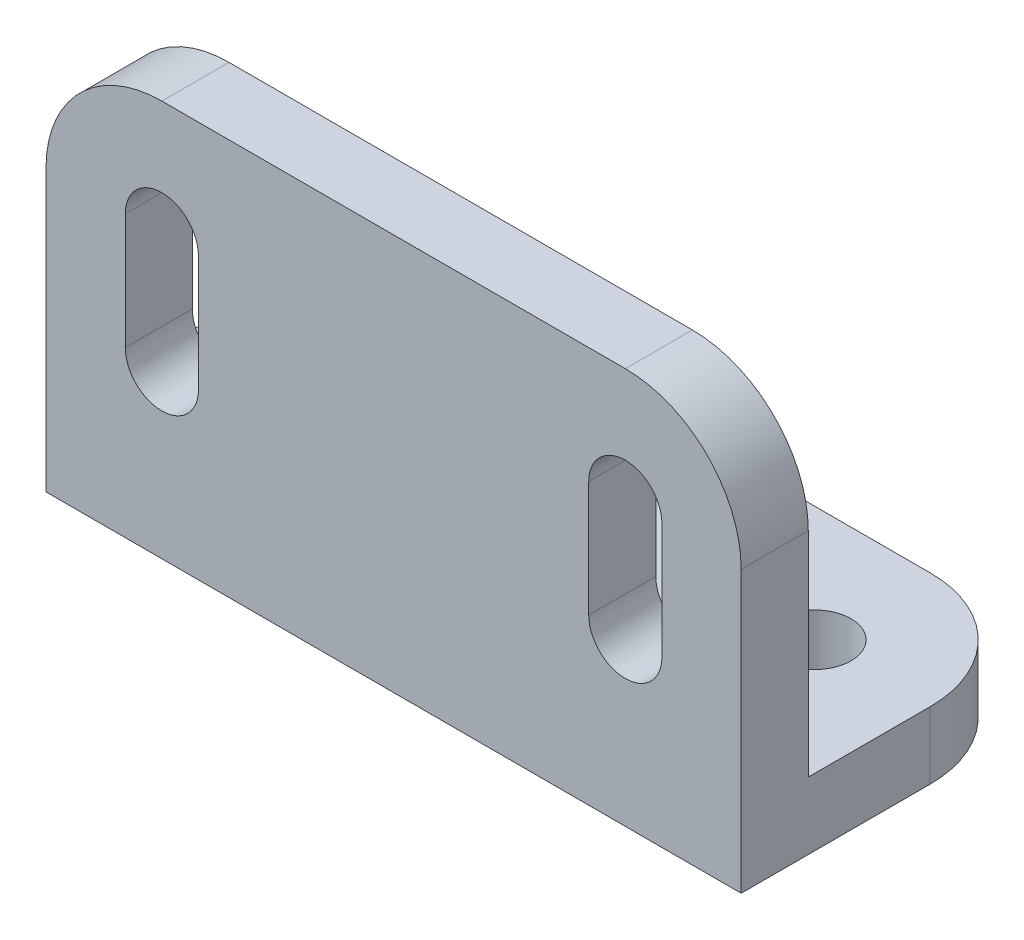
ISO-10303-21;
HEADER;
FILE_DESCRIPTION(('STEP AP214'),'2;1');
FILE_NAME('part.step','',(''),(''),'','','');
FILE_SCHEMA(('AUTOMOTIVE_DESIGN { 1 0 10303 214 1 1 1 1 }'));
ENDSEC;
DATA;
#1=APPLICATION_CONTEXT('core data for automotive mechanical design processes');
#2=APPLICATION_PROTOCOL_DEFINITION('international standard','automotive_design',2000,#1);
#3=PRODUCT_CONTEXT('',#1,'mechanical');
#4=PRODUCT('Part','Part','',(#3));
#5=PRODUCT_RELATED_PRODUCT_CATEGORY('part','',(#4));
#6=PRODUCT_DEFINITION_FORMATION('','',#4);
#7=PRODUCT_DEFINITION_CONTEXT('part definition',#1,'design');
#8=PRODUCT_DEFINITION('design','',#6,#7);
#9=PRODUCT_DEFINITION_SHAPE('','',#8);
#10=(LENGTH_UNIT() NAMED_UNIT(*) SI_UNIT(.MILLI.,.METRE.));
#11=(NAMED_UNIT(*) PLANE_ANGLE_UNIT() SI_UNIT($,.RADIAN.));
#12=(NAMED_UNIT(*) SI_UNIT($,.STERADIAN.) SOLID_ANGLE_UNIT());
#13=UNCERTAINTY_MEASURE_WITH_UNIT(LENGTH_MEASURE(1.E-05),#10,'distance_accuracy_value','');
#14=(GEOMETRIC_REPRESENTATION_CONTEXT(3) GLOBAL_UNCERTAINTY_ASSIGNED_CONTEXT((#13)) GLOBAL_UNIT_ASSIGNED_CONTEXT((#10,
#11,#12)) REPRESENTATION_CONTEXT('',''));
#15=CARTESIAN_POINT('',(0.,0.,0.));
#16=DIRECTION('',(0.,0.,1.));
#17=DIRECTION('',(1.,0.,0.));
#18=AXIS2_PLACEMENT_3D('',#15,#16,#17);
#19=CARTESIAN_POINT('',(0.,11.,0.));
#20=DIRECTION('',(0.,1.,0.));
#21=DIRECTION('',(0.,0.,1.));
#22=AXIS2_PLACEMENT_3D('',#19,#20,#21);
#23=PLANE('',#22);
#24=CARTESIAN_POINT('',(38.,11.,-31.));
#25=DIRECTION('',(0.,1.,0.));
#26=DIRECTION('',(0.,0.,1.));
#27=AXIS2_PLACEMENT_3D('',#24,#25,#26);
#28=CIRCLE('',#27,6.);
#29=CARTESIAN_POINT('',(38.,11.,-25.));
#30=VERTEX_POINT('',#29);
#31=EDGE_CURVE('E391',#30,#30,#28,.F.);
#32=ORIENTED_EDGE('',*,*,#31,.T.);
#33=EDGE_LOOP('',(#32));
#34=FACE_BOUND('',#33,.T.);
#35=DIRECTION('',(-1.,0.,0.));
#36=VECTOR('',#35,1.);
#37=CARTESIAN_POINT('',(-57.,11.,-50.));
#38=LINE('',#37,#36);
#39=CARTESIAN_POINT('',(38.,11.,-50.));
#40=VERTEX_POINT('',#39);
#41=CARTESIAN_POINT('',(3.,11.,-50.));
#42=VERTEX_POINT('',#41);
#43=EDGE_CURVE('E208',#40,#42,#38,.T.);
#44=ORIENTED_EDGE('',*,*,#43,.T.);
#45=DIRECTION('',(0.,0.,1.));
#46=VECTOR('',#45,1.);
#47=CARTESIAN_POINT('',(3.,11.,0.));
#48=LINE('',#47,#46);
#49=CARTESIAN_POINT('',(3.,11.,-11.));
#50=VERTEX_POINT('',#49);
#51=EDGE_CURVE('E184',#42,#50,#48,.T.);
#52=ORIENTED_EDGE('',*,*,#51,.T.);
#53=DIRECTION('',(1.,0.,0.));
#54=VECTOR('',#53,1.);
#55=CARTESIAN_POINT('',(0.,11.,-11.));
#56=LINE('',#55,#54);
#57=CARTESIAN_POINT('',(57.,11.,-11.));
#58=VERTEX_POINT('',#57);
#59=EDGE_CURVE('E416',#50,#58,#56,.T.);
#60=ORIENTED_EDGE('',*,*,#59,.T.);
#61=DIRECTION('',(0.,0.,-1.));
#62=VECTOR('',#61,1.);
#63=CARTESIAN_POINT('',(57.,11.,-50.));
#64=LINE('',#63,#62);
#65=CARTESIAN_POINT('',(57.,11.,-31.));
#66=VERTEX_POINT('',#65);
#67=EDGE_CURVE('E225',#58,#66,#64,.T.);
#68=ORIENTED_EDGE('',*,*,#67,.T.);
#69=CARTESIAN_POINT('',(38.,11.,-31.));
#70=DIRECTION('',(0.,1.,0.));
#71=DIRECTION('',(0.,0.,1.));
#72=AXIS2_PLACEMENT_3D('',#69,#70,#71);
#73=CIRCLE('',#72,19.);
#74=EDGE_CURVE('E216',#66,#40,#73,.T.);
#75=ORIENTED_EDGE('',*,*,#74,.T.);
#76=EDGE_LOOP('',(#44,#52,#60,#68,#75));
#77=FACE_BOUND('',#76,.T.);
#78=ADVANCED_FACE('F39',(#34,#77),#23,.T.);
#79=CARTESIAN_POINT('',(-57.,65.,-11.));
#80=DIRECTION('',(0.,0.,1.));
#81=DIRECTION('',(1.,0.,0.));
#82=AXIS2_PLACEMENT_3D('',#79,#80,#81);
#83=PLANE('',#82);
#84=DIRECTION('',(0.,-1.,0.));
#85=VECTOR('',#84,1.);
#86=CARTESIAN_POINT('',(32.,65.,-11.));
#87=LINE('',#86,#85);
#88=CARTESIAN_POINT('',(32.,46.,-11.));
#89=VERTEX_POINT('',#88);
#90=CARTESIAN_POINT('',(32.,27.,-11.));
#91=VERTEX_POINT('',#90);
#92=EDGE_CURVE('E312',#89,#91,#87,.T.);
#93=ORIENTED_EDGE('',*,*,#92,.T.);
#94=CARTESIAN_POINT('',(38.,27.,-11.));
#95=DIRECTION('',(0.,0.,1.));
#96=DIRECTION('',(1.,0.,0.));
#97=AXIS2_PLACEMENT_3D('',#94,#95,#96);
#98=CIRCLE('',#97,5.99999999999999);
#99=CARTESIAN_POINT('',(44.,27.,-11.));
#100=VERTEX_POINT('',#99);
#101=EDGE_CURVE('E316',#91,#100,#98,.T.);
#102=ORIENTED_EDGE('',*,*,#101,.T.);
#103=DIRECTION('',(0.,1.,0.));
#104=VECTOR('',#103,1.);
#105=CARTESIAN_POINT('',(44.,65.,-11.));
#106=LINE('',#105,#104);
#107=CARTESIAN_POINT('',(44.,46.,-11.));
#108=VERTEX_POINT('',#107);
#109=EDGE_CURVE('E304',#100,#108,#106,.T.);
#110=ORIENTED_EDGE('',*,*,#109,.T.);
#111=CARTESIAN_POINT('',(38.,46.,-11.));
#112=DIRECTION('',(0.,0.,1.));
#113=DIRECTION('',(1.,0.,0.));
#114=AXIS2_PLACEMENT_3D('',#111,#112,#113);
#115=CIRCLE('',#114,6.);
#116=EDGE_CURVE('E308',#108,#89,#115,.T.);
#117=ORIENTED_EDGE('',*,*,#116,.T.);
#118=EDGE_LOOP('',(#93,#102,#110,#117));
#119=FACE_BOUND('',#118,.T.);
#120=DIRECTION('',(0.,-1.,0.));
#121=VECTOR('',#120,1.);
#122=CARTESIAN_POINT('',(3.,65.,-11.));
#123=LINE('',#122,#121);
#124=CARTESIAN_POINT('',(3.,65.,-11.));
#125=VERTEX_POINT('',#124);
#126=EDGE_CURVE('E189',#125,#50,#123,.T.);
#127=ORIENTED_EDGE('',*,*,#126,.F.);
#128=DIRECTION('',(-1.,0.,0.));
#129=VECTOR('',#128,1.);
#130=CARTESIAN_POINT('',(-57.,65.,-11.));
#131=LINE('',#130,#129);
#132=CARTESIAN_POINT('',(38.,65.,-11.));
#133=VERTEX_POINT('',#132);
#134=EDGE_CURVE('E403',#133,#125,#131,.T.);
#135=ORIENTED_EDGE('',*,*,#134,.F.);
#136=CARTESIAN_POINT('',(38.,46.,-11.));
#137=DIRECTION('',(0.,0.,1.));
#138=DIRECTION('',(1.,0.,0.));
#139=AXIS2_PLACEMENT_3D('',#136,#137,#138);
#140=CIRCLE('',#139,19.);
#141=CARTESIAN_POINT('',(57.,46.,-11.));
#142=VERTEX_POINT('',#141);
#143=EDGE_CURVE('E294',#133,#142,#140,.F.);
#144=ORIENTED_EDGE('',*,*,#143,.T.);
#145=DIRECTION('',(0.,-1.,0.));
#146=VECTOR('',#145,1.);
#147=CARTESIAN_POINT('',(57.,65.,-11.));
#148=LINE('',#147,#146);
#149=EDGE_CURVE('E413',#142,#58,#148,.T.);
#150=ORIENTED_EDGE('',*,*,#149,.T.);
#151=ORIENTED_EDGE('',*,*,#59,.F.);
#152=EDGE_LOOP('',(#127,#135,#144,#150,#151));
#153=FACE_BOUND('',#152,.T.);
#154=ADVANCED_FACE('F426',(#119,#153),#83,.F.);
#155=DIRECTION('',(0.,0.,1.));
#156=VECTOR('',#155,1.);
#157=CARTESIAN_POINT('',(-3.,11.,0.));
#158=LINE('',#157,#156);
#159=CARTESIAN_POINT('',(-3.,11.,-50.));
#160=VERTEX_POINT('',#159);
#161=CARTESIAN_POINT('',(-3.,11.,-11.));
#162=VERTEX_POINT('',#161);
#163=EDGE_CURVE('E472',#160,#162,#158,.T.);
#164=ORIENTED_EDGE('',*,*,#163,.F.);
#165=CARTESIAN_POINT('',(-38.,11.,-50.));
#166=VERTEX_POINT('',#165);
#167=EDGE_CURVE('E211',#160,#166,#38,.T.);
#168=ORIENTED_EDGE('',*,*,#167,.T.);
#169=CARTESIAN_POINT('',(-38.,11.,-31.));
#170=DIRECTION('',(0.,1.,0.));
#171=DIRECTION('',(0.,0.,1.));
#172=AXIS2_PLACEMENT_3D('',#169,#170,#171);
#173=CIRCLE('',#172,19.);
#174=CARTESIAN_POINT('',(-57.,11.,-31.));
#175=VERTEX_POINT('',#174);
#176=EDGE_CURVE('E267',#166,#175,#173,.T.);
#177=ORIENTED_EDGE('',*,*,#176,.T.);
#178=DIRECTION('',(0.,0.,1.));
#179=VECTOR('',#178,1.);
#180=CARTESIAN_POINT('',(-57.,11.,-50.));
#181=LINE('',#180,#179);
#182=CARTESIAN_POINT('',(-57.,11.,-11.));
#183=VERTEX_POINT('',#182);
#184=EDGE_CURVE('E218',#175,#183,#181,.T.);
#185=ORIENTED_EDGE('',*,*,#184,.T.);
#186=EDGE_CURVE('E233',#183,#162,#56,.T.);
#187=ORIENTED_EDGE('',*,*,#186,.T.);
#188=EDGE_LOOP('',(#164,#168,#177,#185,#187));
#189=FACE_BOUND('',#188,.T.);
#190=CARTESIAN_POINT('',(-38.,11.,-31.));
#191=DIRECTION('',(0.,1.,0.));
#192=DIRECTION('',(0.,0.,1.));
#193=AXIS2_PLACEMENT_3D('',#190,#191,#192);
#194=CIRCLE('',#193,6.);
#195=CARTESIAN_POINT('',(-38.,11.,-25.));
#196=VERTEX_POINT('',#195);
#197=EDGE_CURVE('E398',#196,#196,#194,.F.);
#198=ORIENTED_EDGE('',*,*,#197,.T.);
#199=EDGE_LOOP('',(#198));
#200=FACE_BOUND('',#199,.T.);
#201=ADVANCED_FACE('F448',(#189,#200),#23,.T.);
#202=CARTESIAN_POINT('',(57.,11.,-50.));
#203=DIRECTION('',(-1.,0.,0.));
#204=DIRECTION('',(0.,0.,1.));
#205=AXIS2_PLACEMENT_3D('',#202,#203,#204);
#206=PLANE('',#205);
#207=ORIENTED_EDGE('',*,*,#149,.F.);
#208=DIRECTION('',(0.,0.,-1.));
#209=VECTOR('',#208,1.);
#210=CARTESIAN_POINT('',(57.,46.,0.));
#211=LINE('',#210,#209);
#212=CARTESIAN_POINT('',(57.,46.,0.));
#213=VERTEX_POINT('',#212);
#214=EDGE_CURVE('E301',#142,#213,#211,.F.);
#215=ORIENTED_EDGE('',*,*,#214,.T.);
#216=DIRECTION('',(0.,-1.,0.));
#217=VECTOR('',#216,1.);
#218=CARTESIAN_POINT('',(57.,11.,0.));
#219=LINE('',#218,#217);
#220=CARTESIAN_POINT('',(57.,0.,0.));
#221=VERTEX_POINT('',#220);
#222=EDGE_CURVE('E223',#213,#221,#219,.T.);
#223=ORIENTED_EDGE('',*,*,#222,.T.);
#224=DIRECTION('',(0.,0.,-1.));
#225=VECTOR('',#224,1.);
#226=CARTESIAN_POINT('',(57.,0.,-50.));
#227=LINE('',#226,#225);
#228=CARTESIAN_POINT('',(57.,0.,-31.));
#229=VERTEX_POINT('',#228);
#230=EDGE_CURVE('E229',#221,#229,#227,.T.);
#231=ORIENTED_EDGE('',*,*,#230,.T.);
#232=DIRECTION('',(0.,-1.,0.));
#233=VECTOR('',#232,1.);
#234=CARTESIAN_POINT('',(57.,11.,-31.));
#235=LINE('',#234,#233);
#236=EDGE_CURVE('E263',#229,#66,#235,.F.);
#237=ORIENTED_EDGE('',*,*,#236,.T.);
#238=ORIENTED_EDGE('',*,*,#67,.F.);
#239=EDGE_LOOP('',(#207,#215,#223,#231,#237,#238));
#240=FACE_BOUND('',#239,.T.);
#241=ADVANCED_FACE('F430',(#240),#206,.F.);
#242=CARTESIAN_POINT('',(-57.,11.,-50.));
#243=DIRECTION('',(0.,0.,1.));
#244=DIRECTION('',(1.,0.,0.));
#245=AXIS2_PLACEMENT_3D('',#242,#243,#244);
#246=PLANE('',#245);
#247=ORIENTED_EDGE('',*,*,#167,.F.);
#248=DIRECTION('',(-1.,0.,0.));
#249=VECTOR('',#248,1.);
#250=CARTESIAN_POINT('',(3.,11.,-50.));
#251=LINE('',#250,#249);
#252=EDGE_CURVE('E198',#42,#160,#251,.T.);
#253=ORIENTED_EDGE('',*,*,#252,.F.);
#254=ORIENTED_EDGE('',*,*,#43,.F.);
#255=DIRECTION('',(0.,-1.,0.));
#256=VECTOR('',#255,1.);
#257=CARTESIAN_POINT('',(38.,11.,-50.));
#258=LINE('',#257,#256);
#259=CARTESIAN_POINT('',(38.,0.,-50.));
#260=VERTEX_POINT('',#259);
#261=EDGE_CURVE('E252',#40,#260,#258,.T.);
#262=ORIENTED_EDGE('',*,*,#261,.T.);
#263=DIRECTION('',(-1.,0.,0.));
#264=VECTOR('',#263,1.);
#265=CARTESIAN_POINT('',(-57.,0.,-50.));
#266=LINE('',#265,#264);
#267=CARTESIAN_POINT('',(-38.,0.,-50.));
#268=VERTEX_POINT('',#267);
#269=EDGE_CURVE('E232',#260,#268,#266,.T.);
#270=ORIENTED_EDGE('',*,*,#269,.T.);
#271=DIRECTION('',(0.,-1.,0.));
#272=VECTOR('',#271,1.);
#273=CARTESIAN_POINT('',(-38.,11.,-50.));
#274=LINE('',#273,#272);
#275=EDGE_CURVE('E249',#268,#166,#274,.F.);
#276=ORIENTED_EDGE('',*,*,#275,.T.);
#277=EDGE_LOOP('',(#247,#253,#254,#262,#270,#276));
#278=FACE_BOUND('',#277,.T.);
#279=ADVANCED_FACE('F206',(#278),#246,.F.);
#280=CARTESIAN_POINT('',(-57.,11.,-50.));
#281=DIRECTION('',(1.,0.,0.));
#282=DIRECTION('',(0.,0.,-1.));
#283=AXIS2_PLACEMENT_3D('',#280,#281,#282);
#284=PLANE('',#283);
#285=DIRECTION('',(0.,-1.,0.));
#286=VECTOR('',#285,1.);
#287=CARTESIAN_POINT('',(-57.,11.,0.));
#288=LINE('',#287,#286);
#289=CARTESIAN_POINT('',(-57.,46.,0.));
#290=VERTEX_POINT('',#289);
#291=CARTESIAN_POINT('',(-57.,0.,0.));
#292=VERTEX_POINT('',#291);
#293=EDGE_CURVE('E246',#290,#292,#288,.T.);
#294=ORIENTED_EDGE('',*,*,#293,.F.);
#295=DIRECTION('',(0.,0.,1.));
#296=VECTOR('',#295,1.);
#297=CARTESIAN_POINT('',(-57.,46.,-11.));
#298=LINE('',#297,#296);
#299=CARTESIAN_POINT('',(-57.,46.,-11.));
#300=VERTEX_POINT('',#299);
#301=EDGE_CURVE('E291',#290,#300,#298,.F.);
#302=ORIENTED_EDGE('',*,*,#301,.T.);
#303=DIRECTION('',(0.,-1.,0.));
#304=VECTOR('',#303,1.);
#305=CARTESIAN_POINT('',(-57.,65.,-11.));
#306=LINE('',#305,#304);
#307=EDGE_CURVE('E410',#300,#183,#306,.T.);
#308=ORIENTED_EDGE('',*,*,#307,.T.);
#309=ORIENTED_EDGE('',*,*,#184,.F.);
#310=DIRECTION('',(0.,-1.,0.));
#311=VECTOR('',#310,1.);
#312=CARTESIAN_POINT('',(-57.,11.,-31.));
#313=LINE('',#312,#311);
#314=CARTESIAN_POINT('',(-57.,0.,-31.));
#315=VERTEX_POINT('',#314);
#316=EDGE_CURVE('E272',#175,#315,#313,.T.);
#317=ORIENTED_EDGE('',*,*,#316,.T.);
#318=DIRECTION('',(0.,0.,1.));
#319=VECTOR('',#318,1.);
#320=CARTESIAN_POINT('',(-57.,0.,-50.));
#321=LINE('',#320,#319);
#322=EDGE_CURVE('E236',#315,#292,#321,.T.);
#323=ORIENTED_EDGE('',*,*,#322,.T.);
#324=EDGE_LOOP('',(#294,#302,#308,#309,#317,#323));
#325=FACE_BOUND('',#324,.T.);
#326=ADVANCED_FACE('F452',(#325),#284,.F.);
#327=CARTESIAN_POINT('',(-57.,11.,0.));
#328=DIRECTION('',(0.,0.,-1.));
#329=DIRECTION('',(-1.,0.,0.));
#330=AXIS2_PLACEMENT_3D('',#327,#328,#329);
#331=PLANE('',#330);
#332=DIRECTION('',(0.,-1.,0.));
#333=VECTOR('',#332,1.);
#334=CARTESIAN_POINT('',(-44.,46.,0.));
#335=LINE('',#334,#333);
#336=CARTESIAN_POINT('',(-44.,46.,0.));
#337=VERTEX_POINT('',#336);
#338=CARTESIAN_POINT('',(-44.,27.,0.));
#339=VERTEX_POINT('',#338);
#340=EDGE_CURVE('E480',#337,#339,#335,.T.);
#341=ORIENTED_EDGE('',*,*,#340,.F.);
#342=CARTESIAN_POINT('',(-38.,46.,0.));
#343=DIRECTION('',(0.,0.,1.));
#344=DIRECTION('',(1.,0.,0.));
#345=AXIS2_PLACEMENT_3D('',#342,#343,#344);
#346=CIRCLE('',#345,6.);
#347=CARTESIAN_POINT('',(-32.,46.,0.));
#348=VERTEX_POINT('',#347);
#349=EDGE_CURVE('E63',#348,#337,#346,.T.);
#350=ORIENTED_EDGE('',*,*,#349,.F.);
#351=DIRECTION('',(0.,1.,0.));
#352=VECTOR('',#351,1.);
#353=CARTESIAN_POINT('',(-32.,46.,0.));
#354=LINE('',#353,#352);
#355=CARTESIAN_POINT('',(-32.,27.,0.));
#356=VERTEX_POINT('',#355);
#357=EDGE_CURVE('E359',#356,#348,#354,.T.);
#358=ORIENTED_EDGE('',*,*,#357,.F.);
#359=CARTESIAN_POINT('',(-38.,27.,0.));
#360=DIRECTION('',(0.,0.,1.));
#361=DIRECTION('',(1.,0.,0.));
#362=AXIS2_PLACEMENT_3D('',#359,#360,#361);
#363=CIRCLE('',#362,6.);
#364=EDGE_CURVE('E344',#339,#356,#363,.T.);
#365=ORIENTED_EDGE('',*,*,#364,.F.);
#366=EDGE_LOOP('',(#341,#350,#358,#365));
#367=FACE_BOUND('',#366,.T.);
#368=DIRECTION('',(1.,0.,0.));
#369=VECTOR('',#368,1.);
#370=CARTESIAN_POINT('',(-57.,0.,0.));
#371=LINE('',#370,#369);
#372=EDGE_CURVE('E240',#292,#221,#371,.T.);
#373=ORIENTED_EDGE('',*,*,#372,.T.);
#374=ORIENTED_EDGE('',*,*,#222,.F.);
#375=CARTESIAN_POINT('',(38.,46.,0.));
#376=DIRECTION('',(0.,0.,-1.));
#377=DIRECTION('',(-1.,0.,0.));
#378=AXIS2_PLACEMENT_3D('',#375,#376,#377);
#379=CIRCLE('',#378,19.);
#380=CARTESIAN_POINT('',(38.,65.,0.));
#381=VERTEX_POINT('',#380);
#382=EDGE_CURVE('E284',#213,#381,#379,.F.);
#383=ORIENTED_EDGE('',*,*,#382,.T.);
#384=DIRECTION('',(1.,0.,0.));
#385=VECTOR('',#384,1.);
#386=CARTESIAN_POINT('',(-57.,65.,0.));
#387=LINE('',#386,#385);
#388=CARTESIAN_POINT('',(-38.,65.,0.));
#389=VERTEX_POINT('',#388);
#390=EDGE_CURVE('E407',#389,#381,#387,.T.);
#391=ORIENTED_EDGE('',*,*,#390,.F.);
#392=CARTESIAN_POINT('',(-38.,46.,0.));
#393=DIRECTION('',(0.,0.,-1.));
#394=DIRECTION('',(-1.,0.,0.));
#395=AXIS2_PLACEMENT_3D('',#392,#393,#394);
#396=CIRCLE('',#395,19.);
#397=EDGE_CURVE('E288',#389,#290,#396,.F.);
#398=ORIENTED_EDGE('',*,*,#397,.T.);
#399=ORIENTED_EDGE('',*,*,#293,.T.);
#400=EDGE_LOOP('',(#373,#374,#383,#391,#398,#399));
#401=FACE_BOUND('',#400,.T.);
#402=DIRECTION('',(0.,1.,0.));
#403=VECTOR('',#402,1.);
#404=CARTESIAN_POINT('',(44.,46.,0.));
#405=LINE('',#404,#403);
#406=CARTESIAN_POINT('',(44.,27.,0.));
#407=VERTEX_POINT('',#406);
#408=CARTESIAN_POINT('',(44.,46.,0.));
#409=VERTEX_POINT('',#408);
#410=EDGE_CURVE('E362',#407,#409,#405,.T.);
#411=ORIENTED_EDGE('',*,*,#410,.F.);
#412=CARTESIAN_POINT('',(38.,27.,0.));
#413=DIRECTION('',(0.,0.,1.));
#414=DIRECTION('',(1.,0.,0.));
#415=AXIS2_PLACEMENT_3D('',#412,#413,#414);
#416=CIRCLE('',#415,5.99999999999999);
#417=CARTESIAN_POINT('',(32.,27.,0.));
#418=VERTEX_POINT('',#417);
#419=EDGE_CURVE('E194',#418,#407,#416,.T.);
#420=ORIENTED_EDGE('',*,*,#419,.F.);
#421=DIRECTION('',(0.,-1.,0.));
#422=VECTOR('',#421,1.);
#423=CARTESIAN_POINT('',(32.,46.,0.));
#424=LINE('',#423,#422);
#425=CARTESIAN_POINT('',(32.,46.,0.));
#426=VERTEX_POINT('',#425);
#427=EDGE_CURVE('E370',#426,#418,#424,.T.);
#428=ORIENTED_EDGE('',*,*,#427,.F.);
#429=CARTESIAN_POINT('',(38.,46.,0.));
#430=DIRECTION('',(0.,0.,1.));
#431=DIRECTION('',(1.,0.,0.));
#432=AXIS2_PLACEMENT_3D('',#429,#430,#431);
#433=CIRCLE('',#432,6.);
#434=EDGE_CURVE('E366',#409,#426,#433,.T.);
#435=ORIENTED_EDGE('',*,*,#434,.F.);
#436=EDGE_LOOP('',(#411,#420,#428,#435));
#437=FACE_BOUND('',#436,.T.);
#438=ADVANCED_FACE('F465',(#367,#401,#437),#331,.F.);
#439=CARTESIAN_POINT('',(0.,0.,0.));
#440=DIRECTION('',(0.,1.,0.));
#441=DIRECTION('',(0.,0.,1.));
#442=AXIS2_PLACEMENT_3D('',#439,#440,#441);
#443=PLANE('',#442);
#444=CARTESIAN_POINT('',(-38.,0.,-31.));
#445=DIRECTION('',(0.,1.,0.));
#446=DIRECTION('',(0.,0.,1.));
#447=AXIS2_PLACEMENT_3D('',#444,#445,#446);
#448=CIRCLE('',#447,6.);
#449=CARTESIAN_POINT('',(-38.,0.,-25.));
#450=VERTEX_POINT('',#449);
#451=EDGE_CURVE('E387',#450,#450,#448,.T.);
#452=ORIENTED_EDGE('',*,*,#451,.T.);
#453=EDGE_LOOP('',(#452));
#454=FACE_BOUND('',#453,.T.);
#455=CARTESIAN_POINT('',(-38.,0.,-31.));
#456=DIRECTION('',(0.,1.,0.));
#457=DIRECTION('',(0.,0.,1.));
#458=AXIS2_PLACEMENT_3D('',#455,#456,#457);
#459=CIRCLE('',#458,19.);
#460=EDGE_CURVE('E255',#315,#268,#459,.F.);
#461=ORIENTED_EDGE('',*,*,#460,.T.);
#462=ORIENTED_EDGE('',*,*,#269,.F.);
#463=CARTESIAN_POINT('',(38.,0.,-31.));
#464=DIRECTION('',(0.,1.,0.));
#465=DIRECTION('',(0.,0.,1.));
#466=AXIS2_PLACEMENT_3D('',#463,#464,#465);
#467=CIRCLE('',#466,19.);
#468=EDGE_CURVE('E259',#260,#229,#467,.F.);
#469=ORIENTED_EDGE('',*,*,#468,.T.);
#470=ORIENTED_EDGE('',*,*,#230,.F.);
#471=ORIENTED_EDGE('',*,*,#372,.F.);
#472=ORIENTED_EDGE('',*,*,#322,.F.);
#473=EDGE_LOOP('',(#461,#462,#469,#470,#471,#472));
#474=FACE_BOUND('',#473,.T.);
#475=CARTESIAN_POINT('',(38.,0.,-31.));
#476=DIRECTION('',(0.,1.,0.));
#477=DIRECTION('',(0.,0.,1.));
#478=AXIS2_PLACEMENT_3D('',#475,#476,#477);
#479=CIRCLE('',#478,6.);
#480=CARTESIAN_POINT('',(38.,0.,-25.));
#481=VERTEX_POINT('',#480);
#482=EDGE_CURVE('E351',#481,#481,#479,.T.);
#483=ORIENTED_EDGE('',*,*,#482,.T.);
#484=EDGE_LOOP('',(#483));
#485=FACE_BOUND('',#484,.T.);
#486=ADVANCED_FACE('F438',(#454,#474,#485),#443,.F.);
#487=CARTESIAN_POINT('',(38.,11.,-31.));
#488=DIRECTION('',(0.,-1.,0.));
#489=DIRECTION('',(0.,0.,-1.));
#490=AXIS2_PLACEMENT_3D('',#487,#488,#489);
#491=CYLINDRICAL_SURFACE('',#490,19.);
#492=ORIENTED_EDGE('',*,*,#74,.F.);
#493=ORIENTED_EDGE('',*,*,#236,.F.);
#494=ORIENTED_EDGE('',*,*,#468,.F.);
#495=ORIENTED_EDGE('',*,*,#261,.F.);
#496=EDGE_LOOP('',(#492,#493,#494,#495));
#497=FACE_BOUND('',#496,.T.);
#498=ADVANCED_FACE('F435',(#497),#491,.T.);
#499=CARTESIAN_POINT('',(-38.,11.,-31.));
#500=DIRECTION('',(0.,-1.,0.));
#501=DIRECTION('',(0.,0.,-1.));
#502=AXIS2_PLACEMENT_3D('',#499,#500,#501);
#503=CYLINDRICAL_SURFACE('',#502,19.);
#504=ORIENTED_EDGE('',*,*,#176,.F.);
#505=ORIENTED_EDGE('',*,*,#275,.F.);
#506=ORIENTED_EDGE('',*,*,#460,.F.);
#507=ORIENTED_EDGE('',*,*,#316,.F.);
#508=EDGE_LOOP('',(#504,#505,#506,#507));
#509=FACE_BOUND('',#508,.T.);
#510=ADVANCED_FACE('F446',(#509),#503,.T.);
#511=DIRECTION('',(0.,1.,0.));
#512=VECTOR('',#511,1.);
#513=CARTESIAN_POINT('',(-32.,65.,-11.));
#514=LINE('',#513,#512);
#515=CARTESIAN_POINT('',(-32.,27.,-11.));
#516=VERTEX_POINT('',#515);
#517=CARTESIAN_POINT('',(-32.,46.,-11.));
#518=VERTEX_POINT('',#517);
#519=EDGE_CURVE('E48',#516,#518,#514,.T.);
#520=ORIENTED_EDGE('',*,*,#519,.T.);
#521=CARTESIAN_POINT('',(-38.,46.,-11.));
#522=DIRECTION('',(0.,0.,1.));
#523=DIRECTION('',(1.,0.,0.));
#524=AXIS2_PLACEMENT_3D('',#521,#522,#523);
#525=CIRCLE('',#524,6.);
#526=CARTESIAN_POINT('',(-44.,46.,-11.));
#527=VERTEX_POINT('',#526);
#528=EDGE_CURVE('E11',#518,#527,#525,.T.);
#529=ORIENTED_EDGE('',*,*,#528,.T.);
#530=DIRECTION('',(0.,-1.,0.));
#531=VECTOR('',#530,1.);
#532=CARTESIAN_POINT('',(-44.,65.,-11.));
#533=LINE('',#532,#531);
#534=CARTESIAN_POINT('',(-44.,27.,-11.));
#535=VERTEX_POINT('',#534);
#536=EDGE_CURVE('E320',#527,#535,#533,.T.);
#537=ORIENTED_EDGE('',*,*,#536,.T.);
#538=CARTESIAN_POINT('',(-38.,27.,-11.));
#539=DIRECTION('',(0.,0.,1.));
#540=DIRECTION('',(1.,0.,0.));
#541=AXIS2_PLACEMENT_3D('',#538,#539,#540);
#542=CIRCLE('',#541,6.);
#543=EDGE_CURVE('E324',#535,#516,#542,.T.);
#544=ORIENTED_EDGE('',*,*,#543,.T.);
#545=EDGE_LOOP('',(#520,#529,#537,#544));
#546=FACE_BOUND('',#545,.T.);
#547=CARTESIAN_POINT('',(-3.00000000000002,65.,-11.));
#548=VERTEX_POINT('',#547);
#549=CARTESIAN_POINT('',(-38.,65.,-11.));
#550=VERTEX_POINT('',#549);
#551=EDGE_CURVE('E402',#548,#550,#131,.T.);
#552=ORIENTED_EDGE('',*,*,#551,.F.);
#553=DIRECTION('',(0.,-1.,0.));
#554=VECTOR('',#553,1.);
#555=CARTESIAN_POINT('',(-3.,65.,-11.));
#556=LINE('',#555,#554);
#557=EDGE_CURVE('E213',#548,#162,#556,.T.);
#558=ORIENTED_EDGE('',*,*,#557,.T.);
#559=ORIENTED_EDGE('',*,*,#186,.F.);
#560=ORIENTED_EDGE('',*,*,#307,.F.);
#561=CARTESIAN_POINT('',(-38.,46.,-11.));
#562=DIRECTION('',(0.,0.,1.));
#563=DIRECTION('',(1.,0.,0.));
#564=AXIS2_PLACEMENT_3D('',#561,#562,#563);
#565=CIRCLE('',#564,19.);
#566=EDGE_CURVE('E297',#300,#550,#565,.F.);
#567=ORIENTED_EDGE('',*,*,#566,.T.);
#568=EDGE_LOOP('',(#552,#558,#559,#560,#567));
#569=FACE_BOUND('',#568,.T.);
#570=ADVANCED_FACE('F330',(#546,#569),#83,.F.);
#571=CARTESIAN_POINT('',(0.,65.,0.));
#572=DIRECTION('',(0.,1.,0.));
#573=DIRECTION('',(0.,0.,1.));
#574=AXIS2_PLACEMENT_3D('',#571,#572,#573);
#575=PLANE('',#574);
#576=ORIENTED_EDGE('',*,*,#390,.T.);
#577=DIRECTION('',(0.,0.,-1.));
#578=VECTOR('',#577,1.);
#579=CARTESIAN_POINT('',(38.,65.,-11.));
#580=LINE('',#579,#578);
#581=EDGE_CURVE('E276',#381,#133,#580,.T.);
#582=ORIENTED_EDGE('',*,*,#581,.T.);
#583=ORIENTED_EDGE('',*,*,#134,.T.);
#584=DIRECTION('',(-1.,0.,0.));
#585=VECTOR('',#584,1.);
#586=CARTESIAN_POINT('',(3.,65.,-11.));
#587=LINE('',#586,#585);
#588=EDGE_CURVE('E200',#125,#548,#587,.T.);
#589=ORIENTED_EDGE('',*,*,#588,.T.);
#590=ORIENTED_EDGE('',*,*,#551,.T.);
#591=DIRECTION('',(0.,0.,1.));
#592=VECTOR('',#591,1.);
#593=CARTESIAN_POINT('',(-38.,65.,0.));
#594=LINE('',#593,#592);
#595=EDGE_CURVE('E280',#550,#389,#594,.T.);
#596=ORIENTED_EDGE('',*,*,#595,.T.);
#597=EDGE_LOOP('',(#576,#582,#583,#589,#590,#596));
#598=FACE_BOUND('',#597,.T.);
#599=ADVANCED_FACE('F463',(#598),#575,.T.);
#600=CARTESIAN_POINT('',(-38.,46.,0.));
#601=DIRECTION('',(0.,0.,-1.));
#602=DIRECTION('',(-1.,0.,0.));
#603=AXIS2_PLACEMENT_3D('',#600,#601,#602);
#604=CYLINDRICAL_SURFACE('',#603,19.);
#605=ORIENTED_EDGE('',*,*,#566,.F.);
#606=ORIENTED_EDGE('',*,*,#301,.F.);
#607=ORIENTED_EDGE('',*,*,#397,.F.);
#608=ORIENTED_EDGE('',*,*,#595,.F.);
#609=EDGE_LOOP('',(#605,#606,#607,#608));
#610=FACE_BOUND('',#609,.T.);
#611=ADVANCED_FACE('F460',(#610),#604,.T.);
#612=CARTESIAN_POINT('',(38.,46.,0.));
#613=DIRECTION('',(0.,0.,1.));
#614=DIRECTION('',(1.,0.,0.));
#615=AXIS2_PLACEMENT_3D('',#612,#613,#614);
#616=CYLINDRICAL_SURFACE('',#615,19.);
#617=ORIENTED_EDGE('',*,*,#382,.F.);
#618=ORIENTED_EDGE('',*,*,#214,.F.);
#619=ORIENTED_EDGE('',*,*,#143,.F.);
#620=ORIENTED_EDGE('',*,*,#581,.F.);
#621=EDGE_LOOP('',(#617,#618,#619,#620));
#622=FACE_BOUND('',#621,.T.);
#623=ADVANCED_FACE('F41',(#622),#616,.T.);
#624=CARTESIAN_POINT('',(38.,65.,-31.));
#625=DIRECTION('',(0.,-1.,0.));
#626=DIRECTION('',(0.,0.,-1.));
#627=AXIS2_PLACEMENT_3D('',#624,#625,#626);
#628=CYLINDRICAL_SURFACE('',#627,6.);
#629=ORIENTED_EDGE('',*,*,#31,.F.);
#630=EDGE_LOOP('',(#629));
#631=FACE_BOUND('',#630,.T.);
#632=ORIENTED_EDGE('',*,*,#482,.F.);
#633=EDGE_LOOP('',(#632));
#634=FACE_BOUND('',#633,.T.);
#635=ADVANCED_FACE('F532',(#631,#634),#628,.F.);
#636=CARTESIAN_POINT('',(-38.,65.,-31.));
#637=DIRECTION('',(0.,-1.,0.));
#638=DIRECTION('',(0.,0.,-1.));
#639=AXIS2_PLACEMENT_3D('',#636,#637,#638);
#640=CYLINDRICAL_SURFACE('',#639,6.);
#641=ORIENTED_EDGE('',*,*,#197,.F.);
#642=EDGE_LOOP('',(#641));
#643=FACE_BOUND('',#642,.T.);
#644=ORIENTED_EDGE('',*,*,#451,.F.);
#645=EDGE_LOOP('',(#644));
#646=FACE_BOUND('',#645,.T.);
#647=ADVANCED_FACE('F540',(#643,#646),#640,.F.);
#648=CARTESIAN_POINT('',(38.,27.,-65.));
#649=DIRECTION('',(0.,0.,1.));
#650=DIRECTION('',(1.,0.,0.));
#651=AXIS2_PLACEMENT_3D('',#648,#649,#650);
#652=CYLINDRICAL_SURFACE('',#651,5.99999999999999);
#653=DIRECTION('',(0.,0.,1.));
#654=VECTOR('',#653,1.);
#655=CARTESIAN_POINT('',(32.,27.,-65.));
#656=LINE('',#655,#654);
#657=EDGE_CURVE('E375',#91,#418,#656,.T.);
#658=ORIENTED_EDGE('',*,*,#657,.T.);
#659=ORIENTED_EDGE('',*,*,#419,.T.);
#660=DIRECTION('',(0.,0.,1.));
#661=VECTOR('',#660,1.);
#662=CARTESIAN_POINT('',(44.,27.,-65.));
#663=LINE('',#662,#661);
#664=EDGE_CURVE('E374',#100,#407,#663,.T.);
#665=ORIENTED_EDGE('',*,*,#664,.F.);
#666=ORIENTED_EDGE('',*,*,#101,.F.);
#667=EDGE_LOOP('',(#658,#659,#665,#666));
#668=FACE_BOUND('',#667,.T.);
#669=ADVANCED_FACE('F544',(#668),#652,.F.);
#670=CARTESIAN_POINT('',(32.,46.,-65.));
#671=DIRECTION('',(-1.,0.,0.));
#672=DIRECTION('',(0.,-1.,0.));
#673=AXIS2_PLACEMENT_3D('',#670,#671,#672);
#674=PLANE('',#673);
#675=DIRECTION('',(0.,0.,1.));
#676=VECTOR('',#675,1.);
#677=CARTESIAN_POINT('',(32.,46.,-65.));
#678=LINE('',#677,#676);
#679=EDGE_CURVE('E378',#89,#426,#678,.T.);
#680=ORIENTED_EDGE('',*,*,#679,.T.);
#681=ORIENTED_EDGE('',*,*,#427,.T.);
#682=ORIENTED_EDGE('',*,*,#657,.F.);
#683=ORIENTED_EDGE('',*,*,#92,.F.);
#684=EDGE_LOOP('',(#680,#681,#682,#683));
#685=FACE_BOUND('',#684,.T.);
#686=ADVANCED_FACE('F547',(#685),#674,.F.);
#687=CARTESIAN_POINT('',(38.,46.,-65.));
#688=DIRECTION('',(0.,0.,1.));
#689=DIRECTION('',(1.,0.,0.));
#690=AXIS2_PLACEMENT_3D('',#687,#688,#689);
#691=CYLINDRICAL_SURFACE('',#690,6.);
#692=DIRECTION('',(0.,0.,1.));
#693=VECTOR('',#692,1.);
#694=CARTESIAN_POINT('',(44.,46.,-65.));
#695=LINE('',#694,#693);
#696=EDGE_CURVE('E381',#108,#409,#695,.T.);
#697=ORIENTED_EDGE('',*,*,#696,.T.);
#698=ORIENTED_EDGE('',*,*,#434,.T.);
#699=ORIENTED_EDGE('',*,*,#679,.F.);
#700=ORIENTED_EDGE('',*,*,#116,.F.);
#701=EDGE_LOOP('',(#697,#698,#699,#700));
#702=FACE_BOUND('',#701,.T.);
#703=ADVANCED_FACE('F499',(#702),#691,.F.);
#704=CARTESIAN_POINT('',(44.,46.,-65.));
#705=DIRECTION('',(1.,0.,0.));
#706=DIRECTION('',(0.,0.,-1.));
#707=AXIS2_PLACEMENT_3D('',#704,#705,#706);
#708=PLANE('',#707);
#709=ORIENTED_EDGE('',*,*,#664,.T.);
#710=ORIENTED_EDGE('',*,*,#410,.T.);
#711=ORIENTED_EDGE('',*,*,#696,.F.);
#712=ORIENTED_EDGE('',*,*,#109,.F.);
#713=EDGE_LOOP('',(#709,#710,#711,#712));
#714=FACE_BOUND('',#713,.T.);
#715=ADVANCED_FACE('F492',(#714),#708,.F.);
#716=CARTESIAN_POINT('',(-38.,46.,-65.));
#717=DIRECTION('',(0.,0.,1.));
#718=DIRECTION('',(1.,0.,0.));
#719=AXIS2_PLACEMENT_3D('',#716,#717,#718);
#720=CYLINDRICAL_SURFACE('',#719,6.);
#721=DIRECTION('',(0.,0.,1.));
#722=VECTOR('',#721,1.);
#723=CARTESIAN_POINT('',(-32.,46.,-65.));
#724=LINE('',#723,#722);
#725=EDGE_CURVE('E340',#518,#348,#724,.T.);
#726=ORIENTED_EDGE('',*,*,#725,.T.);
#727=ORIENTED_EDGE('',*,*,#349,.T.);
#728=DIRECTION('',(0.,0.,1.));
#729=VECTOR('',#728,1.);
#730=CARTESIAN_POINT('',(-44.,46.,-65.));
#731=LINE('',#730,#729);
#732=EDGE_CURVE('E353',#527,#337,#731,.T.);
#733=ORIENTED_EDGE('',*,*,#732,.F.);
#734=ORIENTED_EDGE('',*,*,#528,.F.);
#735=EDGE_LOOP('',(#726,#727,#733,#734));
#736=FACE_BOUND('',#735,.T.);
#737=ADVANCED_FACE('F490',(#736),#720,.F.);
#738=CARTESIAN_POINT('',(-32.,46.,-65.));
#739=DIRECTION('',(1.,0.,0.));
#740=DIRECTION('',(0.,0.,-1.));
#741=AXIS2_PLACEMENT_3D('',#738,#739,#740);
#742=PLANE('',#741);
#743=DIRECTION('',(0.,0.,1.));
#744=VECTOR('',#743,1.);
#745=CARTESIAN_POINT('',(-32.,27.,-65.));
#746=LINE('',#745,#744);
#747=EDGE_CURVE('E338',#516,#356,#746,.T.);
#748=ORIENTED_EDGE('',*,*,#747,.T.);
#749=ORIENTED_EDGE('',*,*,#357,.T.);
#750=ORIENTED_EDGE('',*,*,#725,.F.);
#751=ORIENTED_EDGE('',*,*,#519,.F.);
#752=EDGE_LOOP('',(#748,#749,#750,#751));
#753=FACE_BOUND('',#752,.T.);
#754=ADVANCED_FACE('F336',(#753),#742,.F.);
#755=CARTESIAN_POINT('',(-38.,27.,-65.));
#756=DIRECTION('',(0.,0.,1.));
#757=DIRECTION('',(1.,0.,0.));
#758=AXIS2_PLACEMENT_3D('',#755,#756,#757);
#759=CYLINDRICAL_SURFACE('',#758,6.);
#760=DIRECTION('',(0.,0.,1.));
#761=VECTOR('',#760,1.);
#762=CARTESIAN_POINT('',(-44.,27.,-65.));
#763=LINE('',#762,#761);
#764=EDGE_CURVE('E347',#535,#339,#763,.T.);
#765=ORIENTED_EDGE('',*,*,#764,.T.);
#766=ORIENTED_EDGE('',*,*,#364,.T.);
#767=ORIENTED_EDGE('',*,*,#747,.F.);
#768=ORIENTED_EDGE('',*,*,#543,.F.);
#769=EDGE_LOOP('',(#765,#766,#767,#768));
#770=FACE_BOUND('',#769,.T.);
#771=ADVANCED_FACE('F342',(#770),#759,.F.);
#772=CARTESIAN_POINT('',(-44.,46.,-65.));
#773=DIRECTION('',(-1.,0.,0.));
#774=DIRECTION('',(0.,0.,1.));
#775=AXIS2_PLACEMENT_3D('',#772,#773,#774);
#776=PLANE('',#775);
#777=ORIENTED_EDGE('',*,*,#732,.T.);
#778=ORIENTED_EDGE('',*,*,#340,.T.);
#779=ORIENTED_EDGE('',*,*,#764,.F.);
#780=ORIENTED_EDGE('',*,*,#536,.F.);
#781=EDGE_LOOP('',(#777,#778,#779,#780));
#782=FACE_BOUND('',#781,.T.);
#783=ADVANCED_FACE('F489',(#782),#776,.F.);
#784=CARTESIAN_POINT('',(3.,65.,-11.));
#785=DIRECTION('',(0.,-0.585490553844358,0.810679228399881));
#786=DIRECTION('',(0.,-0.810679228399881,-0.585490553844359));
#787=AXIS2_PLACEMENT_3D('',#784,#785,#786);
#788=PLANE('',#787);
#789=DIRECTION('',(0.,0.810679228399881,0.585490553844359));
#790=VECTOR('',#789,1.);
#791=CARTESIAN_POINT('',(-3.,65.,-11.));
#792=LINE('',#791,#790);
#793=EDGE_CURVE('E55',#160,#548,#792,.T.);
#794=ORIENTED_EDGE('',*,*,#793,.T.);
#795=ORIENTED_EDGE('',*,*,#588,.F.);
#796=DIRECTION('',(0.,0.810679228399881,0.585490553844359));
#797=VECTOR('',#796,1.);
#798=CARTESIAN_POINT('',(3.,65.,-11.));
#799=LINE('',#798,#797);
#800=EDGE_CURVE('E187',#42,#125,#799,.T.);
#801=ORIENTED_EDGE('',*,*,#800,.F.);
#802=ORIENTED_EDGE('',*,*,#252,.T.);
#803=EDGE_LOOP('',(#794,#795,#801,#802));
#804=FACE_BOUND('',#803,.T.);
#805=ADVANCED_FACE('F197',(#804),#788,.F.);
#806=CARTESIAN_POINT('',(3.,0.,0.));
#807=DIRECTION('',(-1.,0.,0.));
#808=DIRECTION('',(0.,0.,1.));
#809=AXIS2_PLACEMENT_3D('',#806,#807,#808);
#810=PLANE('',#809);
#811=ORIENTED_EDGE('',*,*,#51,.F.);
#812=ORIENTED_EDGE('',*,*,#800,.T.);
#813=ORIENTED_EDGE('',*,*,#126,.T.);
#814=EDGE_LOOP('',(#811,#812,#813));
#815=FACE_BOUND('',#814,.T.);
#816=ADVANCED_FACE('F186',(#815),#810,.F.);
#817=CARTESIAN_POINT('',(-3.,0.,0.));
#818=DIRECTION('',(-1.,0.,0.));
#819=DIRECTION('',(0.,0.,1.));
#820=AXIS2_PLACEMENT_3D('',#817,#818,#819);
#821=PLANE('',#820);
#822=ORIENTED_EDGE('',*,*,#793,.F.);
#823=ORIENTED_EDGE('',*,*,#163,.T.);
#824=ORIENTED_EDGE('',*,*,#557,.F.);
#825=EDGE_LOOP('',(#822,#823,#824));
#826=FACE_BOUND('',#825,.T.);
#827=ADVANCED_FACE('F624',(#826),#821,.T.);
#828=CLOSED_SHELL('',(#78,#154,#201,#241,#279,#326,#438,#486,#498,#510,#570,#599,#611,#623,#635,
#647,#669,#686,#703,#715,#737,#754,#771,#783,#805,#816,#827));
#829=MANIFOLD_SOLID_BREP('B2',#828);
#830=ADVANCED_BREP_SHAPE_REPRESENTATION('',(#18,#829),#14);
#831=SHAPE_DEFINITION_REPRESENTATION(#9,#830);
ENDSEC;
END-ISO-10303-21;
